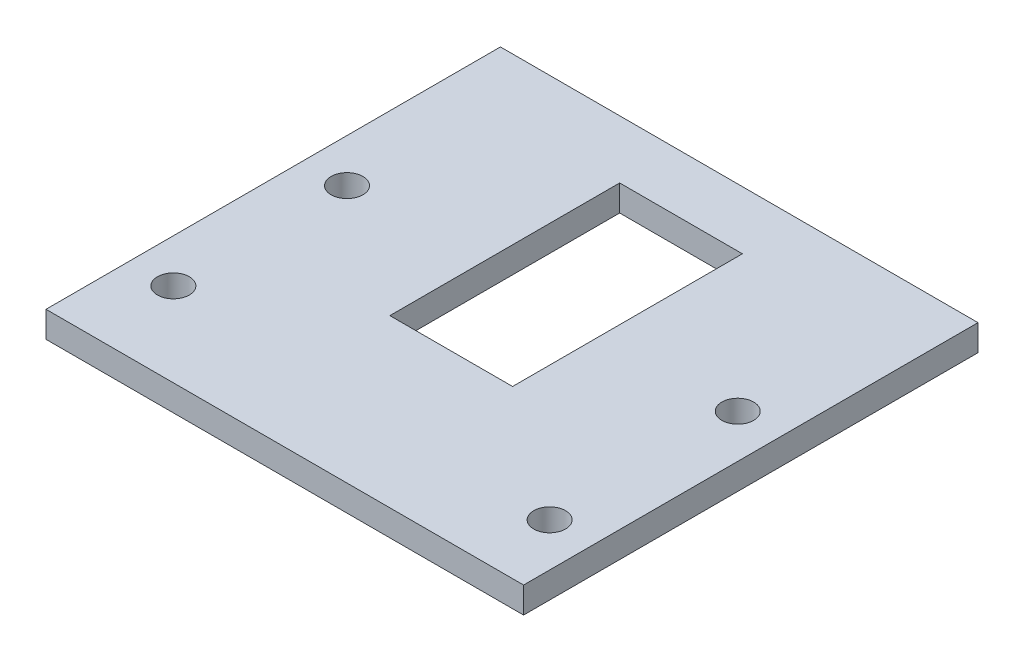
ISO-10303-21;
HEADER;
FILE_DESCRIPTION(('STEP AP214'),'2;1');
FILE_NAME('part.step','',(''),(''),'','','');
FILE_SCHEMA(('AUTOMOTIVE_DESIGN { 1 0 10303 214 1 1 1 1 }'));
ENDSEC;
DATA;
#1=APPLICATION_CONTEXT('core data for automotive mechanical design processes');
#2=APPLICATION_PROTOCOL_DEFINITION('international standard','automotive_design',2000,#1);
#3=PRODUCT_CONTEXT('',#1,'mechanical');
#4=PRODUCT('Part','Part','',(#3));
#5=PRODUCT_RELATED_PRODUCT_CATEGORY('part','',(#4));
#6=PRODUCT_DEFINITION_FORMATION('','',#4);
#7=PRODUCT_DEFINITION_CONTEXT('part definition',#1,'design');
#8=PRODUCT_DEFINITION('design','',#6,#7);
#9=PRODUCT_DEFINITION_SHAPE('','',#8);
#10=(LENGTH_UNIT() NAMED_UNIT(*) SI_UNIT(.MILLI.,.METRE.));
#11=(NAMED_UNIT(*) PLANE_ANGLE_UNIT() SI_UNIT($,.RADIAN.));
#12=(NAMED_UNIT(*) SI_UNIT($,.STERADIAN.) SOLID_ANGLE_UNIT());
#13=UNCERTAINTY_MEASURE_WITH_UNIT(LENGTH_MEASURE(1.E-05),#10,'distance_accuracy_value','');
#14=(GEOMETRIC_REPRESENTATION_CONTEXT(3) GLOBAL_UNCERTAINTY_ASSIGNED_CONTEXT((#13)) GLOBAL_UNIT_ASSIGNED_CONTEXT((#10,
#11,#12)) REPRESENTATION_CONTEXT('',''));
#15=CARTESIAN_POINT('',(0.,0.,0.));
#16=DIRECTION('',(0.,0.,1.));
#17=DIRECTION('',(1.,0.,0.));
#18=AXIS2_PLACEMENT_3D('',#15,#16,#17);
#19=CARTESIAN_POINT('',(0.,2.286,0.));
#20=DIRECTION('',(0.,1.,0.));
#21=DIRECTION('',(0.,0.,1.));
#22=AXIS2_PLACEMENT_3D('',#19,#20,#21);
#23=PLANE('',#22);
#24=DIRECTION('',(0.,0.,-1.));
#25=VECTOR('',#24,1.);
#26=CARTESIAN_POINT('',(-15.5702,2.286,25.273));
#27=LINE('',#26,#25);
#28=CARTESIAN_POINT('',(-15.5702,2.286,25.273));
#29=VERTEX_POINT('',#28);
#30=CARTESIAN_POINT('',(-15.5702,2.286,5.10540000000001));
#31=VERTEX_POINT('',#30);
#32=EDGE_CURVE('E47',#29,#31,#27,.T.);
#33=ORIENTED_EDGE('',*,*,#32,.F.);
#34=DIRECTION('',(1.,0.,0.));
#35=VECTOR('',#34,1.);
#36=CARTESIAN_POINT('',(-26.3398,2.286,25.273));
#37=LINE('',#36,#35);
#38=CARTESIAN_POINT('',(-26.3398,2.286,25.273));
#39=VERTEX_POINT('',#38);
#40=EDGE_CURVE('E115',#39,#29,#37,.T.);
#41=ORIENTED_EDGE('',*,*,#40,.F.);
#42=DIRECTION('',(0.,0.,1.));
#43=VECTOR('',#42,1.);
#44=CARTESIAN_POINT('',(-26.3398,2.286,25.273));
#45=LINE('',#44,#43);
#46=CARTESIAN_POINT('',(-26.3398,2.286,5.10540000000001));
#47=VERTEX_POINT('',#46);
#48=EDGE_CURVE('E118',#47,#39,#45,.T.);
#49=ORIENTED_EDGE('',*,*,#48,.F.);
#50=DIRECTION('',(-1.,0.,0.));
#51=VECTOR('',#50,1.);
#52=CARTESIAN_POINT('',(-26.3398,2.286,5.10540000000001));
#53=LINE('',#52,#51);
#54=EDGE_CURVE('E124',#31,#47,#53,.T.);
#55=ORIENTED_EDGE('',*,*,#54,.F.);
#56=EDGE_LOOP('',(#33,#41,#49,#55));
#57=FACE_BOUND('',#56,.T.);
#58=CARTESIAN_POINT('',(-3.81,2.286,33.782));
#59=DIRECTION('',(0.,1.,0.));
#60=DIRECTION('',(0.,0.,-1.));
#61=AXIS2_PLACEMENT_3D('',#58,#59,#60);
#62=CIRCLE('',#61,1.39700000000001);
#63=CARTESIAN_POINT('',(-3.81,2.286,32.385));
#64=VERTEX_POINT('',#63);
#65=EDGE_CURVE('E140',#64,#64,#62,.T.);
#66=ORIENTED_EDGE('',*,*,#65,.F.);
#67=EDGE_LOOP('',(#66));
#68=FACE_BOUND('',#67,.T.);
#69=CARTESIAN_POINT('',(-38.1,2.286,17.272));
#70=DIRECTION('',(0.,1.,0.));
#71=DIRECTION('',(0.,0.,1.));
#72=AXIS2_PLACEMENT_3D('',#69,#70,#71);
#73=CIRCLE('',#72,1.39700000000001);
#74=CARTESIAN_POINT('',(-38.1,2.286,18.669));
#75=VERTEX_POINT('',#74);
#76=EDGE_CURVE('E152',#75,#75,#73,.T.);
#77=ORIENTED_EDGE('',*,*,#76,.F.);
#78=EDGE_LOOP('',(#77));
#79=FACE_BOUND('',#78,.T.);
#80=DIRECTION('',(0.,0.,-1.));
#81=VECTOR('',#80,1.);
#82=CARTESIAN_POINT('',(0.,2.286,39.878));
#83=LINE('',#82,#81);
#84=CARTESIAN_POINT('',(0.,2.286,39.878));
#85=VERTEX_POINT('',#84);
#86=CARTESIAN_POINT('',(0.,2.286,0.));
#87=VERTEX_POINT('',#86);
#88=EDGE_CURVE('E158',#85,#87,#83,.T.);
#89=ORIENTED_EDGE('',*,*,#88,.T.);
#90=DIRECTION('',(-1.,0.,0.));
#91=VECTOR('',#90,1.);
#92=CARTESIAN_POINT('',(0.,2.286,0.));
#93=LINE('',#92,#91);
#94=CARTESIAN_POINT('',(-41.91,2.286,0.));
#95=VERTEX_POINT('',#94);
#96=EDGE_CURVE('E161',#87,#95,#93,.T.);
#97=ORIENTED_EDGE('',*,*,#96,.T.);
#98=DIRECTION('',(0.,0.,1.));
#99=VECTOR('',#98,1.);
#100=CARTESIAN_POINT('',(-41.91,2.286,0.));
#101=LINE('',#100,#99);
#102=CARTESIAN_POINT('',(-41.91,2.286,39.878));
#103=VERTEX_POINT('',#102);
#104=EDGE_CURVE('E164',#95,#103,#101,.T.);
#105=ORIENTED_EDGE('',*,*,#104,.T.);
#106=DIRECTION('',(1.,0.,0.));
#107=VECTOR('',#106,1.);
#108=CARTESIAN_POINT('',(-41.91,2.286,39.878));
#109=LINE('',#108,#107);
#110=EDGE_CURVE('E166',#103,#85,#109,.T.);
#111=ORIENTED_EDGE('',*,*,#110,.T.);
#112=EDGE_LOOP('',(#89,#97,#105,#111));
#113=FACE_BOUND('',#112,.T.);
#114=CARTESIAN_POINT('',(-38.1,2.286,32.512));
#115=DIRECTION('',(0.,1.,0.));
#116=DIRECTION('',(0.,0.,1.));
#117=AXIS2_PLACEMENT_3D('',#114,#115,#116);
#118=CIRCLE('',#117,1.39700000000001);
#119=CARTESIAN_POINT('',(-38.1,2.286,33.909));
#120=VERTEX_POINT('',#119);
#121=EDGE_CURVE('E146',#120,#120,#118,.T.);
#122=ORIENTED_EDGE('',*,*,#121,.F.);
#123=EDGE_LOOP('',(#122));
#124=FACE_BOUND('',#123,.T.);
#125=CARTESIAN_POINT('',(-3.81000000000001,2.286,17.272));
#126=DIRECTION('',(0.,1.,0.));
#127=DIRECTION('',(0.,0.,-1.));
#128=AXIS2_PLACEMENT_3D('',#125,#126,#127);
#129=CIRCLE('',#128,1.39700000000001);
#130=CARTESIAN_POINT('',(-3.81000000000001,2.286,15.875));
#131=VERTEX_POINT('',#130);
#132=EDGE_CURVE('E134',#131,#131,#129,.T.);
#133=ORIENTED_EDGE('',*,*,#132,.F.);
#134=EDGE_LOOP('',(#133));
#135=FACE_BOUND('',#134,.T.);
#136=ADVANCED_FACE('F32',(#57,#68,#79,#113,#124,#135),#23,.T.);
#137=CARTESIAN_POINT('',(0.,0.,0.));
#138=DIRECTION('',(0.,1.,0.));
#139=DIRECTION('',(0.,0.,1.));
#140=AXIS2_PLACEMENT_3D('',#137,#138,#139);
#141=PLANE('',#140);
#142=DIRECTION('',(1.,0.,0.));
#143=VECTOR('',#142,1.);
#144=CARTESIAN_POINT('',(-26.3398,0.,25.273));
#145=LINE('',#144,#143);
#146=CARTESIAN_POINT('',(-26.3398,0.,25.273));
#147=VERTEX_POINT('',#146);
#148=CARTESIAN_POINT('',(-15.5702,0.,25.273));
#149=VERTEX_POINT('',#148);
#150=EDGE_CURVE('E105',#147,#149,#145,.T.);
#151=ORIENTED_EDGE('',*,*,#150,.T.);
#152=DIRECTION('',(0.,0.,-1.));
#153=VECTOR('',#152,1.);
#154=CARTESIAN_POINT('',(-15.5702,0.,25.273));
#155=LINE('',#154,#153);
#156=CARTESIAN_POINT('',(-15.5702,0.,5.10540000000001));
#157=VERTEX_POINT('',#156);
#158=EDGE_CURVE('E99',#149,#157,#155,.T.);
#159=ORIENTED_EDGE('',*,*,#158,.T.);
#160=DIRECTION('',(-1.,0.,0.));
#161=VECTOR('',#160,1.);
#162=CARTESIAN_POINT('',(-26.3398,0.,5.10540000000001));
#163=LINE('',#162,#161);
#164=CARTESIAN_POINT('',(-26.3398,0.,5.10540000000001));
#165=VERTEX_POINT('',#164);
#166=EDGE_CURVE('E108',#157,#165,#163,.T.);
#167=ORIENTED_EDGE('',*,*,#166,.T.);
#168=DIRECTION('',(0.,0.,1.));
#169=VECTOR('',#168,1.);
#170=CARTESIAN_POINT('',(-26.3398,0.,25.273));
#171=LINE('',#170,#169);
#172=EDGE_CURVE('E55',#165,#147,#171,.T.);
#173=ORIENTED_EDGE('',*,*,#172,.T.);
#174=EDGE_LOOP('',(#151,#159,#167,#173));
#175=FACE_BOUND('',#174,.T.);
#176=CARTESIAN_POINT('',(-3.81,0.,33.782));
#177=DIRECTION('',(0.,1.,0.));
#178=DIRECTION('',(0.,0.,-1.));
#179=AXIS2_PLACEMENT_3D('',#176,#177,#178);
#180=CIRCLE('',#179,1.39700000000001);
#181=CARTESIAN_POINT('',(-3.81,0.,32.385));
#182=VERTEX_POINT('',#181);
#183=EDGE_CURVE('E137',#182,#182,#180,.T.);
#184=ORIENTED_EDGE('',*,*,#183,.T.);
#185=EDGE_LOOP('',(#184));
#186=FACE_BOUND('',#185,.T.);
#187=CARTESIAN_POINT('',(-38.1,0.,17.272));
#188=DIRECTION('',(0.,1.,0.));
#189=DIRECTION('',(0.,0.,1.));
#190=AXIS2_PLACEMENT_3D('',#187,#188,#189);
#191=CIRCLE('',#190,1.39700000000001);
#192=CARTESIAN_POINT('',(-38.1,0.,18.669));
#193=VERTEX_POINT('',#192);
#194=EDGE_CURVE('E149',#193,#193,#191,.T.);
#195=ORIENTED_EDGE('',*,*,#194,.T.);
#196=EDGE_LOOP('',(#195));
#197=FACE_BOUND('',#196,.T.);
#198=DIRECTION('',(0.,0.,-1.));
#199=VECTOR('',#198,1.);
#200=CARTESIAN_POINT('',(0.,0.,39.878));
#201=LINE('',#200,#199);
#202=CARTESIAN_POINT('',(0.,0.,39.878));
#203=VERTEX_POINT('',#202);
#204=CARTESIAN_POINT('',(0.,0.,0.));
#205=VERTEX_POINT('',#204);
#206=EDGE_CURVE('E155',#203,#205,#201,.T.);
#207=ORIENTED_EDGE('',*,*,#206,.F.);
#208=DIRECTION('',(1.,0.,0.));
#209=VECTOR('',#208,1.);
#210=CARTESIAN_POINT('',(-41.91,0.,39.878));
#211=LINE('',#210,#209);
#212=CARTESIAN_POINT('',(-41.91,0.,39.878));
#213=VERTEX_POINT('',#212);
#214=EDGE_CURVE('E162',#213,#203,#211,.T.);
#215=ORIENTED_EDGE('',*,*,#214,.F.);
#216=DIRECTION('',(0.,0.,1.));
#217=VECTOR('',#216,1.);
#218=CARTESIAN_POINT('',(-41.91,0.,0.));
#219=LINE('',#218,#217);
#220=CARTESIAN_POINT('',(-41.91,0.,0.));
#221=VERTEX_POINT('',#220);
#222=EDGE_CURVE('E173',#221,#213,#219,.T.);
#223=ORIENTED_EDGE('',*,*,#222,.F.);
#224=DIRECTION('',(-1.,0.,0.));
#225=VECTOR('',#224,1.);
#226=CARTESIAN_POINT('',(0.,0.,0.));
#227=LINE('',#226,#225);
#228=EDGE_CURVE('E171',#205,#221,#227,.T.);
#229=ORIENTED_EDGE('',*,*,#228,.F.);
#230=EDGE_LOOP('',(#207,#215,#223,#229));
#231=FACE_BOUND('',#230,.T.);
#232=CARTESIAN_POINT('',(-38.1,0.,32.512));
#233=DIRECTION('',(0.,1.,0.));
#234=DIRECTION('',(0.,0.,1.));
#235=AXIS2_PLACEMENT_3D('',#232,#233,#234);
#236=CIRCLE('',#235,1.39700000000001);
#237=CARTESIAN_POINT('',(-38.1,0.,33.909));
#238=VERTEX_POINT('',#237);
#239=EDGE_CURVE('E143',#238,#238,#236,.T.);
#240=ORIENTED_EDGE('',*,*,#239,.T.);
#241=EDGE_LOOP('',(#240));
#242=FACE_BOUND('',#241,.T.);
#243=CARTESIAN_POINT('',(-3.81000000000001,0.,17.272));
#244=DIRECTION('',(0.,1.,0.));
#245=DIRECTION('',(0.,0.,-1.));
#246=AXIS2_PLACEMENT_3D('',#243,#244,#245);
#247=CIRCLE('',#246,1.39700000000001);
#248=CARTESIAN_POINT('',(-3.81000000000001,0.,15.875));
#249=VERTEX_POINT('',#248);
#250=EDGE_CURVE('E130',#249,#249,#247,.T.);
#251=ORIENTED_EDGE('',*,*,#250,.T.);
#252=EDGE_LOOP('',(#251));
#253=FACE_BOUND('',#252,.T.);
#254=ADVANCED_FACE('F112',(#175,#186,#197,#231,#242,#253),#141,.F.);
#255=CARTESIAN_POINT('',(0.,2.286,39.878));
#256=DIRECTION('',(-1.,0.,0.));
#257=DIRECTION('',(0.,0.,1.));
#258=AXIS2_PLACEMENT_3D('',#255,#256,#257);
#259=PLANE('',#258);
#260=ORIENTED_EDGE('',*,*,#206,.T.);
#261=DIRECTION('',(0.,-1.,0.));
#262=VECTOR('',#261,1.);
#263=CARTESIAN_POINT('',(0.,2.286,0.));
#264=LINE('',#263,#262);
#265=EDGE_CURVE('E11',#87,#205,#264,.T.);
#266=ORIENTED_EDGE('',*,*,#265,.F.);
#267=ORIENTED_EDGE('',*,*,#88,.F.);
#268=DIRECTION('',(0.,-1.,0.));
#269=VECTOR('',#268,1.);
#270=CARTESIAN_POINT('',(0.,2.286,39.878));
#271=LINE('',#270,#269);
#272=EDGE_CURVE('E168',#85,#203,#271,.T.);
#273=ORIENTED_EDGE('',*,*,#272,.T.);
#274=EDGE_LOOP('',(#260,#266,#267,#273));
#275=FACE_BOUND('',#274,.T.);
#276=ADVANCED_FACE('F34',(#275),#259,.F.);
#277=CARTESIAN_POINT('',(0.,2.286,0.));
#278=DIRECTION('',(0.,0.,1.));
#279=DIRECTION('',(1.,0.,0.));
#280=AXIS2_PLACEMENT_3D('',#277,#278,#279);
#281=PLANE('',#280);
#282=ORIENTED_EDGE('',*,*,#228,.T.);
#283=DIRECTION('',(0.,-1.,0.));
#284=VECTOR('',#283,1.);
#285=CARTESIAN_POINT('',(-41.91,2.286,0.));
#286=LINE('',#285,#284);
#287=EDGE_CURVE('E40',#95,#221,#286,.T.);
#288=ORIENTED_EDGE('',*,*,#287,.F.);
#289=ORIENTED_EDGE('',*,*,#96,.F.);
#290=ORIENTED_EDGE('',*,*,#265,.T.);
#291=EDGE_LOOP('',(#282,#288,#289,#290));
#292=FACE_BOUND('',#291,.T.);
#293=ADVANCED_FACE('F201',(#292),#281,.F.);
#294=CARTESIAN_POINT('',(-41.91,2.286,0.));
#295=DIRECTION('',(1.,0.,0.));
#296=DIRECTION('',(0.,0.,-1.));
#297=AXIS2_PLACEMENT_3D('',#294,#295,#296);
#298=PLANE('',#297);
#299=ORIENTED_EDGE('',*,*,#222,.T.);
#300=DIRECTION('',(0.,-1.,0.));
#301=VECTOR('',#300,1.);
#302=CARTESIAN_POINT('',(-41.91,2.286,39.878));
#303=LINE('',#302,#301);
#304=EDGE_CURVE('E178',#103,#213,#303,.T.);
#305=ORIENTED_EDGE('',*,*,#304,.F.);
#306=ORIENTED_EDGE('',*,*,#104,.F.);
#307=ORIENTED_EDGE('',*,*,#287,.T.);
#308=EDGE_LOOP('',(#299,#305,#306,#307));
#309=FACE_BOUND('',#308,.T.);
#310=ADVANCED_FACE('F185',(#309),#298,.F.);
#311=CARTESIAN_POINT('',(-41.91,2.286,39.878));
#312=DIRECTION('',(0.,0.,-1.));
#313=DIRECTION('',(-1.,0.,0.));
#314=AXIS2_PLACEMENT_3D('',#311,#312,#313);
#315=PLANE('',#314);
#316=ORIENTED_EDGE('',*,*,#214,.T.);
#317=ORIENTED_EDGE('',*,*,#272,.F.);
#318=ORIENTED_EDGE('',*,*,#110,.F.);
#319=ORIENTED_EDGE('',*,*,#304,.T.);
#320=EDGE_LOOP('',(#316,#317,#318,#319));
#321=FACE_BOUND('',#320,.T.);
#322=ADVANCED_FACE('F194',(#321),#315,.F.);
#323=CARTESIAN_POINT('',(-38.1,2.286,17.272));
#324=DIRECTION('',(0.,-1.,0.));
#325=DIRECTION('',(0.,0.,-1.));
#326=AXIS2_PLACEMENT_3D('',#323,#324,#325);
#327=CYLINDRICAL_SURFACE('',#326,1.39700000000001);
#328=ORIENTED_EDGE('',*,*,#76,.T.);
#329=EDGE_LOOP('',(#328));
#330=FACE_BOUND('',#329,.T.);
#331=ORIENTED_EDGE('',*,*,#194,.F.);
#332=EDGE_LOOP('',(#331));
#333=FACE_BOUND('',#332,.T.);
#334=ADVANCED_FACE('F217',(#330,#333),#327,.F.);
#335=CARTESIAN_POINT('',(-38.1,2.286,32.512));
#336=DIRECTION('',(0.,-1.,0.));
#337=DIRECTION('',(0.,0.,-1.));
#338=AXIS2_PLACEMENT_3D('',#335,#336,#337);
#339=CYLINDRICAL_SURFACE('',#338,1.39700000000001);
#340=ORIENTED_EDGE('',*,*,#121,.T.);
#341=EDGE_LOOP('',(#340));
#342=FACE_BOUND('',#341,.T.);
#343=ORIENTED_EDGE('',*,*,#239,.F.);
#344=EDGE_LOOP('',(#343));
#345=FACE_BOUND('',#344,.T.);
#346=ADVANCED_FACE('F224',(#342,#345),#339,.F.);
#347=CARTESIAN_POINT('',(-3.81,2.286,33.782));
#348=DIRECTION('',(0.,-1.,0.));
#349=DIRECTION('',(0.,0.,-1.));
#350=AXIS2_PLACEMENT_3D('',#347,#348,#349);
#351=CYLINDRICAL_SURFACE('',#350,1.39700000000001);
#352=ORIENTED_EDGE('',*,*,#65,.T.);
#353=EDGE_LOOP('',(#352));
#354=FACE_BOUND('',#353,.T.);
#355=ORIENTED_EDGE('',*,*,#183,.F.);
#356=EDGE_LOOP('',(#355));
#357=FACE_BOUND('',#356,.T.);
#358=ADVANCED_FACE('F229',(#354,#357),#351,.F.);
#359=CARTESIAN_POINT('',(-3.81000000000001,2.286,17.272));
#360=DIRECTION('',(0.,-1.,0.));
#361=DIRECTION('',(0.,0.,-1.));
#362=AXIS2_PLACEMENT_3D('',#359,#360,#361);
#363=CYLINDRICAL_SURFACE('',#362,1.39700000000001);
#364=ORIENTED_EDGE('',*,*,#132,.T.);
#365=EDGE_LOOP('',(#364));
#366=FACE_BOUND('',#365,.T.);
#367=ORIENTED_EDGE('',*,*,#250,.F.);
#368=EDGE_LOOP('',(#367));
#369=FACE_BOUND('',#368,.T.);
#370=ADVANCED_FACE('F239',(#366,#369),#363,.F.);
#371=CARTESIAN_POINT('',(-15.5702,0.,25.273));
#372=DIRECTION('',(1.,0.,0.));
#373=DIRECTION('',(0.,0.,-1.));
#374=AXIS2_PLACEMENT_3D('',#371,#372,#373);
#375=PLANE('',#374);
#376=ORIENTED_EDGE('',*,*,#32,.T.);
#377=DIRECTION('',(0.,1.,0.));
#378=VECTOR('',#377,1.);
#379=CARTESIAN_POINT('',(-15.5702,0.,5.10540000000001));
#380=LINE('',#379,#378);
#381=EDGE_CURVE('E95',#157,#31,#380,.T.);
#382=ORIENTED_EDGE('',*,*,#381,.F.);
#383=ORIENTED_EDGE('',*,*,#158,.F.);
#384=DIRECTION('',(0.,1.,0.));
#385=VECTOR('',#384,1.);
#386=CARTESIAN_POINT('',(-15.5702,0.,25.273));
#387=LINE('',#386,#385);
#388=EDGE_CURVE('E128',#149,#29,#387,.T.);
#389=ORIENTED_EDGE('',*,*,#388,.T.);
#390=EDGE_LOOP('',(#376,#382,#383,#389));
#391=FACE_BOUND('',#390,.T.);
#392=ADVANCED_FACE('F97',(#391),#375,.F.);
#393=CARTESIAN_POINT('',(-26.3398,0.,25.273));
#394=DIRECTION('',(0.,0.,1.));
#395=DIRECTION('',(1.,0.,0.));
#396=AXIS2_PLACEMENT_3D('',#393,#394,#395);
#397=PLANE('',#396);
#398=ORIENTED_EDGE('',*,*,#40,.T.);
#399=ORIENTED_EDGE('',*,*,#388,.F.);
#400=ORIENTED_EDGE('',*,*,#150,.F.);
#401=DIRECTION('',(0.,1.,0.));
#402=VECTOR('',#401,1.);
#403=CARTESIAN_POINT('',(-26.3398,0.,25.273));
#404=LINE('',#403,#402);
#405=EDGE_CURVE('E131',#147,#39,#404,.T.);
#406=ORIENTED_EDGE('',*,*,#405,.T.);
#407=EDGE_LOOP('',(#398,#399,#400,#406));
#408=FACE_BOUND('',#407,.T.);
#409=ADVANCED_FACE('F249',(#408),#397,.F.);
#410=CARTESIAN_POINT('',(-26.3398,0.,25.273));
#411=DIRECTION('',(-1.,0.,0.));
#412=DIRECTION('',(0.,0.,1.));
#413=AXIS2_PLACEMENT_3D('',#410,#411,#412);
#414=PLANE('',#413);
#415=ORIENTED_EDGE('',*,*,#48,.T.);
#416=ORIENTED_EDGE('',*,*,#405,.F.);
#417=ORIENTED_EDGE('',*,*,#172,.F.);
#418=DIRECTION('',(0.,1.,0.));
#419=VECTOR('',#418,1.);
#420=CARTESIAN_POINT('',(-26.3398,0.,5.10540000000001));
#421=LINE('',#420,#419);
#422=EDGE_CURVE('E104',#165,#47,#421,.T.);
#423=ORIENTED_EDGE('',*,*,#422,.T.);
#424=EDGE_LOOP('',(#415,#416,#417,#423));
#425=FACE_BOUND('',#424,.T.);
#426=ADVANCED_FACE('F252',(#425),#414,.F.);
#427=CARTESIAN_POINT('',(-26.3398,0.,5.10540000000001));
#428=DIRECTION('',(0.,0.,-1.));
#429=DIRECTION('',(-1.,0.,0.));
#430=AXIS2_PLACEMENT_3D('',#427,#428,#429);
#431=PLANE('',#430);
#432=ORIENTED_EDGE('',*,*,#54,.T.);
#433=ORIENTED_EDGE('',*,*,#422,.F.);
#434=ORIENTED_EDGE('',*,*,#166,.F.);
#435=ORIENTED_EDGE('',*,*,#381,.T.);
#436=EDGE_LOOP('',(#432,#433,#434,#435));
#437=FACE_BOUND('',#436,.T.);
#438=ADVANCED_FACE('F109',(#437),#431,.F.);
#439=CLOSED_SHELL('',(#136,#254,#276,#293,#310,#322,#334,#346,#358,#370,#392,#409,#426,#438));
#440=MANIFOLD_SOLID_BREP('B2',#439);
#441=ADVANCED_BREP_SHAPE_REPRESENTATION('',(#18,#440),#14);
#442=SHAPE_DEFINITION_REPRESENTATION(#9,#441);
ENDSEC;
END-ISO-10303-21;
